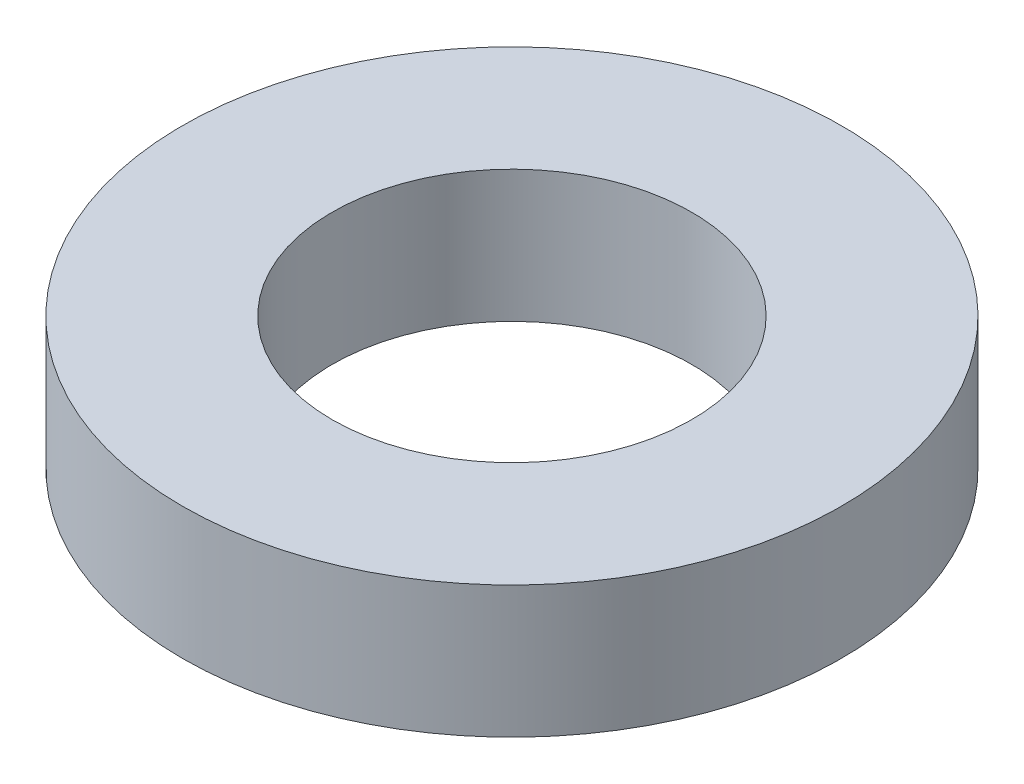
ISO-10303-21;
HEADER;
FILE_DESCRIPTION(('STEP AP214'),'2;1');
FILE_NAME('part.step','',(''),(''),'','','');
FILE_SCHEMA(('AUTOMOTIVE_DESIGN { 1 0 10303 214 1 1 1 1 }'));
ENDSEC;
DATA;
#1=APPLICATION_CONTEXT('core data for automotive mechanical design processes');
#2=APPLICATION_PROTOCOL_DEFINITION('international standard','automotive_design',2000,#1);
#3=PRODUCT_CONTEXT('',#1,'mechanical');
#4=PRODUCT('Part','Part','',(#3));
#5=PRODUCT_RELATED_PRODUCT_CATEGORY('part','',(#4));
#6=PRODUCT_DEFINITION_FORMATION('','',#4);
#7=PRODUCT_DEFINITION_CONTEXT('part definition',#1,'design');
#8=PRODUCT_DEFINITION('design','',#6,#7);
#9=PRODUCT_DEFINITION_SHAPE('','',#8);
#10=(LENGTH_UNIT() NAMED_UNIT(*) SI_UNIT(.MILLI.,.METRE.));
#11=(NAMED_UNIT(*) PLANE_ANGLE_UNIT() SI_UNIT($,.RADIAN.));
#12=(NAMED_UNIT(*) SI_UNIT($,.STERADIAN.) SOLID_ANGLE_UNIT());
#13=UNCERTAINTY_MEASURE_WITH_UNIT(LENGTH_MEASURE(1.E-05),#10,'distance_accuracy_value','');
#14=(GEOMETRIC_REPRESENTATION_CONTEXT(3) GLOBAL_UNCERTAINTY_ASSIGNED_CONTEXT((#13)) GLOBAL_UNIT_ASSIGNED_CONTEXT((#10,
#11,#12)) REPRESENTATION_CONTEXT('',''));
#15=CARTESIAN_POINT('',(0.,0.,0.));
#16=DIRECTION('',(0.,0.,1.));
#17=DIRECTION('',(1.,0.,0.));
#18=AXIS2_PLACEMENT_3D('',#15,#16,#17);
#19=CARTESIAN_POINT('',(0.,11.,0.));
#20=DIRECTION('',(0.,-1.,0.));
#21=DIRECTION('',(0.,0.,-1.));
#22=AXIS2_PLACEMENT_3D('',#19,#20,#21);
#23=CYLINDRICAL_SURFACE('',#22,27.5);
#24=CARTESIAN_POINT('',(0.,11.,0.));
#25=DIRECTION('',(0.,1.,0.));
#26=DIRECTION('',(0.,0.,1.));
#27=AXIS2_PLACEMENT_3D('',#24,#25,#26);
#28=CIRCLE('',#27,27.5);
#29=CARTESIAN_POINT('',(0.,11.,27.5));
#30=VERTEX_POINT('',#29);
#31=EDGE_CURVE('E10',#30,#30,#28,.T.);
#32=ORIENTED_EDGE('',*,*,#31,.F.);
#33=EDGE_LOOP('',(#32));
#34=FACE_BOUND('',#33,.T.);
#35=CARTESIAN_POINT('',(0.,0.,0.));
#36=DIRECTION('',(0.,1.,0.));
#37=DIRECTION('',(0.,0.,1.));
#38=AXIS2_PLACEMENT_3D('',#35,#36,#37);
#39=CIRCLE('',#38,27.5);
#40=CARTESIAN_POINT('',(0.,0.,27.5));
#41=VERTEX_POINT('',#40);
#42=EDGE_CURVE('E37',#41,#41,#39,.T.);
#43=ORIENTED_EDGE('',*,*,#42,.T.);
#44=EDGE_LOOP('',(#43));
#45=FACE_BOUND('',#44,.T.);
#46=ADVANCED_FACE('F40',(#34,#45),#23,.T.);
#47=CARTESIAN_POINT('',(0.,11.,0.));
#48=DIRECTION('',(0.,1.,0.));
#49=DIRECTION('',(0.,0.,1.));
#50=AXIS2_PLACEMENT_3D('',#47,#48,#49);
#51=PLANE('',#50);
#52=CARTESIAN_POINT('',(0.,11.,0.));
#53=DIRECTION('',(0.,1.,0.));
#54=DIRECTION('',(0.,0.,1.));
#55=AXIS2_PLACEMENT_3D('',#52,#53,#54);
#56=CIRCLE('',#55,15.);
#57=CARTESIAN_POINT('',(0.,11.,15.));
#58=VERTEX_POINT('',#57);
#59=EDGE_CURVE('E50',#58,#58,#56,.T.);
#60=ORIENTED_EDGE('',*,*,#59,.F.);
#61=EDGE_LOOP('',(#60));
#62=FACE_BOUND('',#61,.T.);
#63=ORIENTED_EDGE('',*,*,#31,.T.);
#64=EDGE_LOOP('',(#63));
#65=FACE_BOUND('',#64,.T.);
#66=ADVANCED_FACE('F59',(#62,#65),#51,.T.);
#67=CARTESIAN_POINT('',(0.,0.,0.));
#68=DIRECTION('',(0.,1.,0.));
#69=DIRECTION('',(0.,0.,1.));
#70=AXIS2_PLACEMENT_3D('',#67,#68,#69);
#71=PLANE('',#70);
#72=CARTESIAN_POINT('',(0.,0.,0.));
#73=DIRECTION('',(0.,1.,0.));
#74=DIRECTION('',(0.,0.,1.));
#75=AXIS2_PLACEMENT_3D('',#72,#73,#74);
#76=CIRCLE('',#75,15.);
#77=CARTESIAN_POINT('',(0.,0.,15.));
#78=VERTEX_POINT('',#77);
#79=EDGE_CURVE('E47',#78,#78,#76,.T.);
#80=ORIENTED_EDGE('',*,*,#79,.T.);
#81=EDGE_LOOP('',(#80));
#82=FACE_BOUND('',#81,.T.);
#83=ORIENTED_EDGE('',*,*,#42,.F.);
#84=EDGE_LOOP('',(#83));
#85=FACE_BOUND('',#84,.T.);
#86=ADVANCED_FACE('F58',(#82,#85),#71,.F.);
#87=CARTESIAN_POINT('',(0.,11.,0.));
#88=DIRECTION('',(0.,-1.,0.));
#89=DIRECTION('',(0.,0.,-1.));
#90=AXIS2_PLACEMENT_3D('',#87,#88,#89);
#91=CYLINDRICAL_SURFACE('',#90,15.);
#92=ORIENTED_EDGE('',*,*,#59,.T.);
#93=EDGE_LOOP('',(#92));
#94=FACE_BOUND('',#93,.T.);
#95=ORIENTED_EDGE('',*,*,#79,.F.);
#96=EDGE_LOOP('',(#95));
#97=FACE_BOUND('',#96,.T.);
#98=ADVANCED_FACE('F54',(#94,#97),#91,.F.);
#99=CLOSED_SHELL('',(#46,#66,#86,#98));
#100=MANIFOLD_SOLID_BREP('B2',#99);
#101=ADVANCED_BREP_SHAPE_REPRESENTATION('',(#18,#100),#14);
#102=SHAPE_DEFINITION_REPRESENTATION(#9,#101);
ENDSEC;
END-ISO-10303-21;
